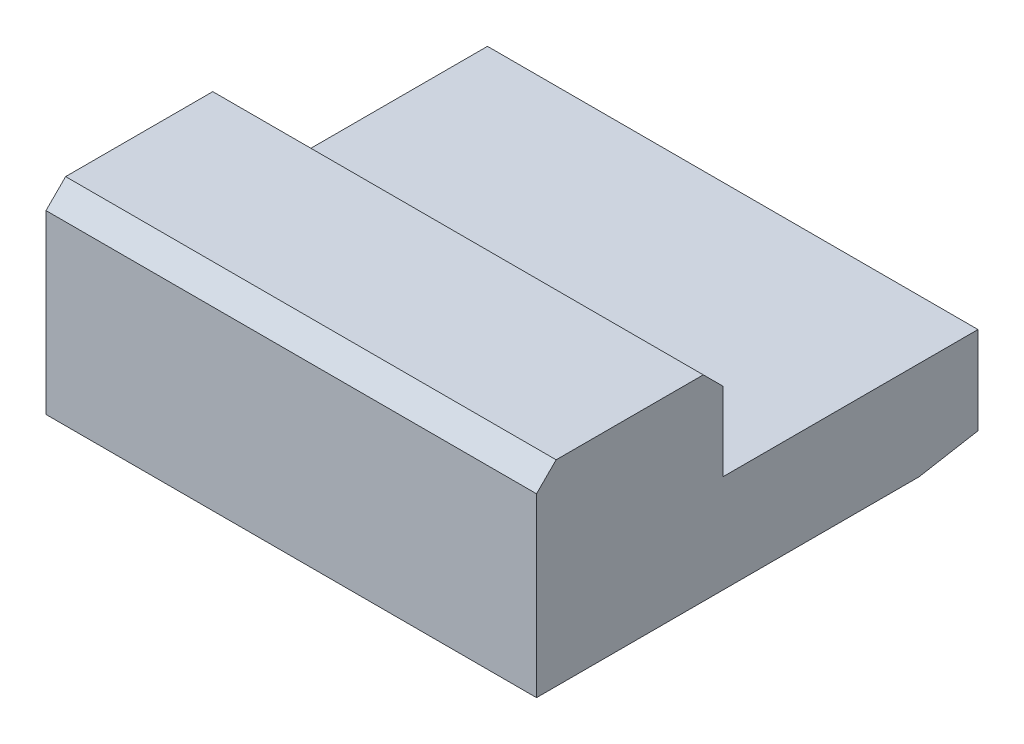
ISO-10303-21;
HEADER;
FILE_DESCRIPTION(('STEP AP214'),'2;1');
FILE_NAME('part.step','',(''),(''),'','','');
FILE_SCHEMA(('AUTOMOTIVE_DESIGN { 1 0 10303 214 1 1 1 1 }'));
ENDSEC;
DATA;
#1=APPLICATION_CONTEXT('core data for automotive mechanical design processes');
#2=APPLICATION_PROTOCOL_DEFINITION('international standard','automotive_design',2000,#1);
#3=PRODUCT_CONTEXT('',#1,'mechanical');
#4=PRODUCT('Part','Part','',(#3));
#5=PRODUCT_RELATED_PRODUCT_CATEGORY('part','',(#4));
#6=PRODUCT_DEFINITION_FORMATION('','',#4);
#7=PRODUCT_DEFINITION_CONTEXT('part definition',#1,'design');
#8=PRODUCT_DEFINITION('design','',#6,#7);
#9=PRODUCT_DEFINITION_SHAPE('','',#8);
#10=(LENGTH_UNIT() NAMED_UNIT(*) SI_UNIT(.MILLI.,.METRE.));
#11=(NAMED_UNIT(*) PLANE_ANGLE_UNIT() SI_UNIT($,.RADIAN.));
#12=(NAMED_UNIT(*) SI_UNIT($,.STERADIAN.) SOLID_ANGLE_UNIT());
#13=UNCERTAINTY_MEASURE_WITH_UNIT(LENGTH_MEASURE(1.E-05),#10,'distance_accuracy_value','');
#14=(GEOMETRIC_REPRESENTATION_CONTEXT(3) GLOBAL_UNCERTAINTY_ASSIGNED_CONTEXT((#13)) GLOBAL_UNIT_ASSIGNED_CONTEXT((#10,
#11,#12)) REPRESENTATION_CONTEXT('',''));
#15=CARTESIAN_POINT('',(0.,0.,0.));
#16=DIRECTION('',(0.,0.,1.));
#17=DIRECTION('',(1.,0.,0.));
#18=AXIS2_PLACEMENT_3D('',#15,#16,#17);
#19=CARTESIAN_POINT('',(0.,1.9,0.1));
#20=DIRECTION('',(0.,0.707106781186548,-0.707106781186548));
#21=DIRECTION('',(0.,0.707106781186548,0.707106781186548));
#22=AXIS2_PLACEMENT_3D('',#19,#20,#21);
#23=PLANE('',#22);
#24=DIRECTION('',(1.,0.,0.));
#25=VECTOR('',#24,1.);
#26=CARTESIAN_POINT('',(2.5,2.,0.2));
#27=LINE('',#26,#25);
#28=CARTESIAN_POINT('',(2.5,2.,0.2));
#29=VERTEX_POINT('',#28);
#30=CARTESIAN_POINT('',(-2.5,2.,0.2));
#31=VERTEX_POINT('',#30);
#32=EDGE_CURVE('E99',#29,#31,#27,.F.);
#33=ORIENTED_EDGE('',*,*,#32,.F.);
#34=DIRECTION('',(0.,0.707106781186548,0.707106781186548));
#35=VECTOR('',#34,1.);
#36=CARTESIAN_POINT('',(2.5,1.9,0.1));
#37=LINE('',#36,#35);
#38=CARTESIAN_POINT('',(2.5,1.8,0.));
#39=VERTEX_POINT('',#38);
#40=EDGE_CURVE('E89',#29,#39,#37,.F.);
#41=ORIENTED_EDGE('',*,*,#40,.T.);
#42=DIRECTION('',(1.,0.,0.));
#43=VECTOR('',#42,1.);
#44=CARTESIAN_POINT('',(0.,1.8,0.));
#45=LINE('',#44,#43);
#46=CARTESIAN_POINT('',(-2.5,1.8,0.));
#47=VERTEX_POINT('',#46);
#48=EDGE_CURVE('E110',#39,#47,#45,.F.);
#49=ORIENTED_EDGE('',*,*,#48,.T.);
#50=DIRECTION('',(0.,0.707106781186548,0.707106781186548));
#51=VECTOR('',#50,1.);
#52=CARTESIAN_POINT('',(-2.5,1.9,0.1));
#53=LINE('',#52,#51);
#54=EDGE_CURVE('E19',#47,#31,#53,.T.);
#55=ORIENTED_EDGE('',*,*,#54,.T.);
#56=EDGE_LOOP('',(#33,#41,#49,#55));
#57=FACE_BOUND('',#56,.T.);
#58=ADVANCED_FACE('F16',(#57),#23,.T.);
#59=CARTESIAN_POINT('',(2.5,2.,0.));
#60=DIRECTION('',(0.,1.,0.));
#61=DIRECTION('',(0.,0.,1.));
#62=AXIS2_PLACEMENT_3D('',#59,#60,#61);
#63=PLANE('',#62);
#64=DIRECTION('',(0.,0.,1.));
#65=VECTOR('',#64,1.);
#66=CARTESIAN_POINT('',(-2.5,2.,0.));
#67=LINE('',#66,#65);
#68=CARTESIAN_POINT('',(-2.5,2.,1.7));
#69=VERTEX_POINT('',#68);
#70=EDGE_CURVE('E101',#31,#69,#67,.T.);
#71=ORIENTED_EDGE('',*,*,#70,.T.);
#72=DIRECTION('',(1.,0.,0.));
#73=VECTOR('',#72,1.);
#74=CARTESIAN_POINT('',(0.,2.,1.7));
#75=LINE('',#74,#73);
#76=CARTESIAN_POINT('',(2.5,2.,1.7));
#77=VERTEX_POINT('',#76);
#78=EDGE_CURVE('E105',#77,#69,#75,.F.);
#79=ORIENTED_EDGE('',*,*,#78,.F.);
#80=DIRECTION('',(0.,0.,1.));
#81=VECTOR('',#80,1.);
#82=CARTESIAN_POINT('',(2.5,2.,0.));
#83=LINE('',#82,#81);
#84=EDGE_CURVE('E93',#77,#29,#83,.F.);
#85=ORIENTED_EDGE('',*,*,#84,.T.);
#86=ORIENTED_EDGE('',*,*,#32,.T.);
#87=EDGE_LOOP('',(#71,#79,#85,#86));
#88=FACE_BOUND('',#87,.T.);
#89=ADVANCED_FACE('F103',(#88),#63,.T.);
#90=CARTESIAN_POINT('',(0.,0.,0.));
#91=DIRECTION('',(0.,0.,1.));
#92=DIRECTION('',(1.,0.,0.));
#93=AXIS2_PLACEMENT_3D('',#90,#91,#92);
#94=PLANE('',#93);
#95=DIRECTION('',(1.,0.,0.));
#96=VECTOR('',#95,1.);
#97=CARTESIAN_POINT('',(-2.5,1.,0.));
#98=LINE('',#97,#96);
#99=CARTESIAN_POINT('',(-2.5,1.,0.));
#100=VERTEX_POINT('',#99);
#101=CARTESIAN_POINT('',(2.5,1.,0.));
#102=VERTEX_POINT('',#101);
#103=EDGE_CURVE('E118',#100,#102,#98,.T.);
#104=ORIENTED_EDGE('',*,*,#103,.F.);
#105=DIRECTION('',(0.,1.,0.));
#106=VECTOR('',#105,1.);
#107=CARTESIAN_POINT('',(-2.5,0.,0.));
#108=LINE('',#107,#106);
#109=EDGE_CURVE('E112',#47,#100,#108,.F.);
#110=ORIENTED_EDGE('',*,*,#109,.F.);
#111=ORIENTED_EDGE('',*,*,#48,.F.);
#112=DIRECTION('',(0.,1.,0.));
#113=VECTOR('',#112,1.);
#114=CARTESIAN_POINT('',(2.5,0.,0.));
#115=LINE('',#114,#113);
#116=EDGE_CURVE('E96',#102,#39,#115,.T.);
#117=ORIENTED_EDGE('',*,*,#116,.F.);
#118=EDGE_LOOP('',(#104,#110,#111,#117));
#119=FACE_BOUND('',#118,.T.);
#120=ADVANCED_FACE('F180',(#119),#94,.F.);
#121=CARTESIAN_POINT('',(0.,1.9,1.8));
#122=DIRECTION('',(0.,0.707106781186548,0.707106781186548));
#123=DIRECTION('',(0.,-0.707106781186548,0.707106781186548));
#124=AXIS2_PLACEMENT_3D('',#121,#122,#123);
#125=PLANE('',#124);
#126=ORIENTED_EDGE('',*,*,#78,.T.);
#127=DIRECTION('',(0.,-0.707106781186548,0.707106781186548));
#128=VECTOR('',#127,1.);
#129=CARTESIAN_POINT('',(-2.5,1.9,1.8));
#130=LINE('',#129,#128);
#131=CARTESIAN_POINT('',(-2.5,1.8,1.9));
#132=VERTEX_POINT('',#131);
#133=EDGE_CURVE('E116',#69,#132,#130,.T.);
#134=ORIENTED_EDGE('',*,*,#133,.T.);
#135=DIRECTION('',(1.,0.,0.));
#136=VECTOR('',#135,1.);
#137=CARTESIAN_POINT('',(0.,1.8,1.9));
#138=LINE('',#137,#136);
#139=CARTESIAN_POINT('',(2.5,1.8,1.9));
#140=VERTEX_POINT('',#139);
#141=EDGE_CURVE('E134',#140,#132,#138,.F.);
#142=ORIENTED_EDGE('',*,*,#141,.F.);
#143=DIRECTION('',(0.,-0.707106781186547,0.707106781186548));
#144=VECTOR('',#143,1.);
#145=CARTESIAN_POINT('',(2.5,2.,1.7));
#146=LINE('',#145,#144);
#147=EDGE_CURVE('E126',#77,#140,#146,.T.);
#148=ORIENTED_EDGE('',*,*,#147,.F.);
#149=EDGE_LOOP('',(#126,#134,#142,#148));
#150=FACE_BOUND('',#149,.T.);
#151=ADVANCED_FACE('F166',(#150),#125,.T.);
#152=CARTESIAN_POINT('',(-2.5,1.,0.));
#153=DIRECTION('',(0.,1.,0.));
#154=DIRECTION('',(0.,0.,1.));
#155=AXIS2_PLACEMENT_3D('',#152,#153,#154);
#156=PLANE('',#155);
#157=DIRECTION('',(0.,0.,-1.));
#158=VECTOR('',#157,1.);
#159=CARTESIAN_POINT('',(2.5,1.,0.));
#160=LINE('',#159,#158);
#161=CARTESIAN_POINT('',(2.5,1.,-2.6));
#162=VERTEX_POINT('',#161);
#163=EDGE_CURVE('E124',#162,#102,#160,.F.);
#164=ORIENTED_EDGE('',*,*,#163,.F.);
#165=DIRECTION('',(-1.,0.,0.));
#166=VECTOR('',#165,1.);
#167=CARTESIAN_POINT('',(0.,1.,-2.6));
#168=LINE('',#167,#166);
#169=CARTESIAN_POINT('',(-2.5,1.,-2.6));
#170=VERTEX_POINT('',#169);
#171=EDGE_CURVE('E121',#170,#162,#168,.F.);
#172=ORIENTED_EDGE('',*,*,#171,.F.);
#173=DIRECTION('',(0.,0.,1.));
#174=VECTOR('',#173,1.);
#175=CARTESIAN_POINT('',(-2.5,1.,0.));
#176=LINE('',#175,#174);
#177=EDGE_CURVE('E140',#100,#170,#176,.F.);
#178=ORIENTED_EDGE('',*,*,#177,.F.);
#179=ORIENTED_EDGE('',*,*,#103,.T.);
#180=EDGE_LOOP('',(#164,#172,#178,#179));
#181=FACE_BOUND('',#180,.T.);
#182=ADVANCED_FACE('F178',(#181),#156,.T.);
#183=CARTESIAN_POINT('',(0.,0.,-2.6));
#184=DIRECTION('',(0.,0.,-1.));
#185=DIRECTION('',(-1.,0.,0.));
#186=AXIS2_PLACEMENT_3D('',#183,#184,#185);
#187=PLANE('',#186);
#188=ORIENTED_EDGE('',*,*,#171,.T.);
#189=DIRECTION('',(0.,1.,0.));
#190=VECTOR('',#189,1.);
#191=CARTESIAN_POINT('',(2.5,0.,-2.6));
#192=LINE('',#191,#190);
#193=CARTESIAN_POINT('',(2.5,0.10604032122068,-2.6));
#194=VERTEX_POINT('',#193);
#195=EDGE_CURVE('E128',#194,#162,#192,.T.);
#196=ORIENTED_EDGE('',*,*,#195,.F.);
#197=DIRECTION('',(1.,0.,0.));
#198=VECTOR('',#197,1.);
#199=CARTESIAN_POINT('',(-2.5,0.106040321220618,-2.60000000000001));
#200=LINE('',#199,#198);
#201=CARTESIAN_POINT('',(-2.5,0.10604032122068,-2.6));
#202=VERTEX_POINT('',#201);
#203=EDGE_CURVE('E145',#194,#202,#200,.F.);
#204=ORIENTED_EDGE('',*,*,#203,.T.);
#205=DIRECTION('',(0.,1.,0.));
#206=VECTOR('',#205,1.);
#207=CARTESIAN_POINT('',(-2.5,2.,-2.6));
#208=LINE('',#207,#206);
#209=EDGE_CURVE('E143',#170,#202,#208,.F.);
#210=ORIENTED_EDGE('',*,*,#209,.F.);
#211=EDGE_LOOP('',(#188,#196,#204,#210));
#212=FACE_BOUND('',#211,.T.);
#213=ADVANCED_FACE('F173',(#212),#187,.T.);
#214=CARTESIAN_POINT('',(2.5,0.,0.));
#215=DIRECTION('',(1.,0.,0.));
#216=DIRECTION('',(0.,0.,-1.));
#217=AXIS2_PLACEMENT_3D('',#214,#215,#216);
#218=PLANE('',#217);
#219=DIRECTION('',(0.,-0.173648177666902,0.984807753012213));
#220=VECTOR('',#219,1.);
#221=CARTESIAN_POINT('',(2.5,0.,-1.998615454115));
#222=LINE('',#221,#220);
#223=CARTESIAN_POINT('',(2.5,0.,-1.99861545411499));
#224=VERTEX_POINT('',#223);
#225=EDGE_CURVE('E148',#224,#194,#222,.F.);
#226=ORIENTED_EDGE('',*,*,#225,.T.);
#227=ORIENTED_EDGE('',*,*,#195,.T.);
#228=ORIENTED_EDGE('',*,*,#163,.T.);
#229=ORIENTED_EDGE('',*,*,#116,.T.);
#230=ORIENTED_EDGE('',*,*,#40,.F.);
#231=ORIENTED_EDGE('',*,*,#84,.F.);
#232=ORIENTED_EDGE('',*,*,#147,.T.);
#233=DIRECTION('',(0.,1.,0.));
#234=VECTOR('',#233,1.);
#235=CARTESIAN_POINT('',(2.5,0.,1.9));
#236=LINE('',#235,#234);
#237=CARTESIAN_POINT('',(2.5,0.,1.9));
#238=VERTEX_POINT('',#237);
#239=EDGE_CURVE('E131',#238,#140,#236,.T.);
#240=ORIENTED_EDGE('',*,*,#239,.F.);
#241=DIRECTION('',(0.,0.,-1.));
#242=VECTOR('',#241,1.);
#243=CARTESIAN_POINT('',(2.5,0.,0.));
#244=LINE('',#243,#242);
#245=EDGE_CURVE('E150',#224,#238,#244,.F.);
#246=ORIENTED_EDGE('',*,*,#245,.F.);
#247=EDGE_LOOP('',(#226,#227,#228,#229,#230,#231,#232,#240,#246));
#248=FACE_BOUND('',#247,.T.);
#249=ADVANCED_FACE('F91',(#248),#218,.T.);
#250=CARTESIAN_POINT('',(0.,0.,1.9));
#251=DIRECTION('',(0.,0.,1.));
#252=DIRECTION('',(1.,0.,0.));
#253=AXIS2_PLACEMENT_3D('',#250,#251,#252);
#254=PLANE('',#253);
#255=ORIENTED_EDGE('',*,*,#239,.T.);
#256=ORIENTED_EDGE('',*,*,#141,.T.);
#257=DIRECTION('',(0.,1.,0.));
#258=VECTOR('',#257,1.);
#259=CARTESIAN_POINT('',(-2.5,2.,1.9));
#260=LINE('',#259,#258);
#261=CARTESIAN_POINT('',(-2.5,0.,1.9));
#262=VERTEX_POINT('',#261);
#263=EDGE_CURVE('E137',#262,#132,#260,.T.);
#264=ORIENTED_EDGE('',*,*,#263,.F.);
#265=DIRECTION('',(1.,0.,0.));
#266=VECTOR('',#265,1.);
#267=CARTESIAN_POINT('',(-2.5,0.,1.9));
#268=LINE('',#267,#266);
#269=EDGE_CURVE('E153',#238,#262,#268,.F.);
#270=ORIENTED_EDGE('',*,*,#269,.F.);
#271=EDGE_LOOP('',(#255,#256,#264,#270));
#272=FACE_BOUND('',#271,.T.);
#273=ADVANCED_FACE('F163',(#272),#254,.T.);
#274=CARTESIAN_POINT('',(-2.5,2.,0.));
#275=DIRECTION('',(-1.,0.,0.));
#276=DIRECTION('',(0.,0.,1.));
#277=AXIS2_PLACEMENT_3D('',#274,#275,#276);
#278=PLANE('',#277);
#279=ORIENTED_EDGE('',*,*,#177,.T.);
#280=ORIENTED_EDGE('',*,*,#209,.T.);
#281=DIRECTION('',(0.,-0.173648177666902,0.984807753012213));
#282=VECTOR('',#281,1.);
#283=CARTESIAN_POINT('',(-2.5,0.,-1.998615454115));
#284=LINE('',#283,#282);
#285=CARTESIAN_POINT('',(-2.5,0.,-1.998615454115));
#286=VERTEX_POINT('',#285);
#287=EDGE_CURVE('E34',#202,#286,#284,.T.);
#288=ORIENTED_EDGE('',*,*,#287,.T.);
#289=DIRECTION('',(0.,0.,-1.));
#290=VECTOR('',#289,1.);
#291=CARTESIAN_POINT('',(-2.5,0.,0.));
#292=LINE('',#291,#290);
#293=EDGE_CURVE('E25',#262,#286,#292,.T.);
#294=ORIENTED_EDGE('',*,*,#293,.F.);
#295=ORIENTED_EDGE('',*,*,#263,.T.);
#296=ORIENTED_EDGE('',*,*,#133,.F.);
#297=ORIENTED_EDGE('',*,*,#70,.F.);
#298=ORIENTED_EDGE('',*,*,#54,.F.);
#299=ORIENTED_EDGE('',*,*,#109,.T.);
#300=EDGE_LOOP('',(#279,#280,#288,#294,#295,#296,#297,#298,#299));
#301=FACE_BOUND('',#300,.T.);
#302=ADVANCED_FACE('F160',(#301),#278,.T.);
#303=CARTESIAN_POINT('',(-2.5,0.,-1.998615454115));
#304=DIRECTION('',(0.,0.984807753012213,0.173648177666902));
#305=DIRECTION('',(0.,-0.173648177666902,0.984807753012213));
#306=AXIS2_PLACEMENT_3D('',#303,#304,#305);
#307=PLANE('',#306);
#308=DIRECTION('',(1.,0.,0.));
#309=VECTOR('',#308,1.);
#310=CARTESIAN_POINT('',(-2.5,0.,-1.998615454115));
#311=LINE('',#310,#309);
#312=EDGE_CURVE('E11',#286,#224,#311,.T.);
#313=ORIENTED_EDGE('',*,*,#312,.F.);
#314=ORIENTED_EDGE('',*,*,#287,.F.);
#315=ORIENTED_EDGE('',*,*,#203,.F.);
#316=ORIENTED_EDGE('',*,*,#225,.F.);
#317=EDGE_LOOP('',(#313,#314,#315,#316));
#318=FACE_BOUND('',#317,.T.);
#319=ADVANCED_FACE('F170',(#318),#307,.F.);
#320=CARTESIAN_POINT('',(-2.5,0.,0.));
#321=DIRECTION('',(0.,-1.,0.));
#322=DIRECTION('',(0.,0.,-1.));
#323=AXIS2_PLACEMENT_3D('',#320,#321,#322);
#324=PLANE('',#323);
#325=ORIENTED_EDGE('',*,*,#293,.T.);
#326=ORIENTED_EDGE('',*,*,#312,.T.);
#327=ORIENTED_EDGE('',*,*,#245,.T.);
#328=ORIENTED_EDGE('',*,*,#269,.T.);
#329=EDGE_LOOP('',(#325,#326,#327,#328));
#330=FACE_BOUND('',#329,.T.);
#331=ADVANCED_FACE('F158',(#330),#324,.T.);
#332=CLOSED_SHELL('',(#58,#89,#120,#151,#182,#213,#249,#273,#302,#319,#331));
#333=MANIFOLD_SOLID_BREP('B1',#332);
#334=ADVANCED_BREP_SHAPE_REPRESENTATION('',(#18,#333),#14);
#335=SHAPE_DEFINITION_REPRESENTATION(#9,#334);
ENDSEC;
END-ISO-10303-21;
